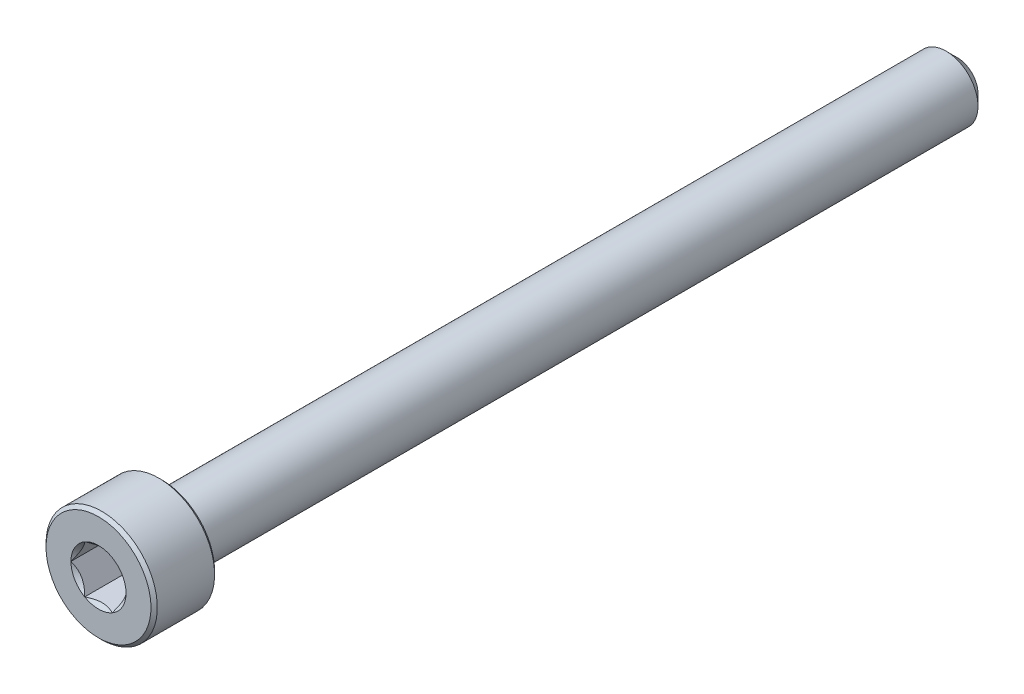
ISO-10303-21;
HEADER;
FILE_DESCRIPTION(('STEP AP214'),'2;1');
FILE_NAME('part.step','',(''),(''),'','','');
FILE_SCHEMA(('AUTOMOTIVE_DESIGN { 1 0 10303 214 1 1 1 1 }'));
ENDSEC;
DATA;
#1=APPLICATION_CONTEXT('core data for automotive mechanical design processes');
#2=APPLICATION_PROTOCOL_DEFINITION('international standard','automotive_design',2000,#1);
#3=PRODUCT_CONTEXT('',#1,'mechanical');
#4=PRODUCT('Part','Part','',(#3));
#5=PRODUCT_RELATED_PRODUCT_CATEGORY('part','',(#4));
#6=PRODUCT_DEFINITION_FORMATION('','',#4);
#7=PRODUCT_DEFINITION_CONTEXT('part definition',#1,'design');
#8=PRODUCT_DEFINITION('design','',#6,#7);
#9=PRODUCT_DEFINITION_SHAPE('','',#8);
#10=(LENGTH_UNIT() NAMED_UNIT(*) SI_UNIT(.MILLI.,.METRE.));
#11=(NAMED_UNIT(*) PLANE_ANGLE_UNIT() SI_UNIT($,.RADIAN.));
#12=(NAMED_UNIT(*) SI_UNIT($,.STERADIAN.) SOLID_ANGLE_UNIT());
#13=UNCERTAINTY_MEASURE_WITH_UNIT(LENGTH_MEASURE(1.E-05),#10,'distance_accuracy_value','');
#14=(GEOMETRIC_REPRESENTATION_CONTEXT(3) GLOBAL_UNCERTAINTY_ASSIGNED_CONTEXT((#13)) GLOBAL_UNIT_ASSIGNED_CONTEXT((#10,
#11,#12)) REPRESENTATION_CONTEXT('',''));
#15=CARTESIAN_POINT('',(0.,0.,0.));
#16=DIRECTION('',(0.,0.,1.));
#17=DIRECTION('',(1.,0.,0.));
#18=AXIS2_PLACEMENT_3D('',#15,#16,#17);
#19=CARTESIAN_POINT('',(0.,0.,27.));
#20=DIRECTION('',(0.,0.,1.));
#21=DIRECTION('',(1.,0.,0.));
#22=AXIS2_PLACEMENT_3D('',#19,#20,#21);
#23=PLANE('',#22);
#24=CARTESIAN_POINT('',(0.,0.,27.));
#25=DIRECTION('',(0.,0.,1.));
#26=DIRECTION('',(1.,0.,0.));
#27=AXIS2_PLACEMENT_3D('',#24,#25,#26);
#28=CIRCLE('',#27,1.73205080756888);
#29=CARTESIAN_POINT('',(1.73205080756888,0.,27.));
#30=VERTEX_POINT('',#29);
#31=CARTESIAN_POINT('',(0.866025403784439,1.5,27.));
#32=VERTEX_POINT('',#31);
#33=EDGE_CURVE('E112',#30,#32,#28,.T.);
#34=ORIENTED_EDGE('',*,*,#33,.F.);
#35=CARTESIAN_POINT('',(0.866025403784438,-1.5,27.));
#36=VERTEX_POINT('',#35);
#37=EDGE_CURVE('E101',#36,#30,#28,.T.);
#38=ORIENTED_EDGE('',*,*,#37,.F.);
#39=CARTESIAN_POINT('',(-0.866025403784438,-1.5,27.));
#40=VERTEX_POINT('',#39);
#41=EDGE_CURVE('E110',#40,#36,#28,.T.);
#42=ORIENTED_EDGE('',*,*,#41,.F.);
#43=CARTESIAN_POINT('',(-1.73205080756888,0.,27.));
#44=VERTEX_POINT('',#43);
#45=EDGE_CURVE('E298',#44,#40,#28,.T.);
#46=ORIENTED_EDGE('',*,*,#45,.F.);
#47=CARTESIAN_POINT('',(-0.866025403784438,1.5,27.));
#48=VERTEX_POINT('',#47);
#49=EDGE_CURVE('E138',#48,#44,#28,.T.);
#50=ORIENTED_EDGE('',*,*,#49,.F.);
#51=EDGE_CURVE('E135',#32,#48,#28,.T.);
#52=ORIENTED_EDGE('',*,*,#51,.F.);
#53=EDGE_LOOP('',(#34,#38,#42,#46,#50,#52));
#54=FACE_BOUND('',#53,.T.);
#55=CARTESIAN_POINT('',(0.,0.,27.));
#56=DIRECTION('',(0.,0.,-1.));
#57=DIRECTION('',(-1.,0.,0.));
#58=AXIS2_PLACEMENT_3D('',#55,#56,#57);
#59=CIRCLE('',#58,3.3);
#60=CARTESIAN_POINT('',(-3.3,0.,27.));
#61=VERTEX_POINT('',#60);
#62=EDGE_CURVE('E55',#61,#61,#59,.T.);
#63=ORIENTED_EDGE('',*,*,#62,.F.);
#64=EDGE_LOOP('',(#63));
#65=FACE_BOUND('',#64,.T.);
#66=ADVANCED_FACE('F41',(#54,#65),#23,.T.);
#67=CARTESIAN_POINT('',(0.,0.,26.8));
#68=DIRECTION('',(0.,0.,-1.));
#69=DIRECTION('',(-1.,0.,0.));
#70=AXIS2_PLACEMENT_3D('',#67,#68,#69);
#71=CONICAL_SURFACE('',#70,3.5,0.785398163397454);
#72=ORIENTED_EDGE('',*,*,#62,.T.);
#73=EDGE_LOOP('',(#72));
#74=FACE_BOUND('',#73,.T.);
#75=CARTESIAN_POINT('',(0.,0.,26.8));
#76=DIRECTION('',(0.,0.,-1.));
#77=DIRECTION('',(-1.,0.,0.));
#78=AXIS2_PLACEMENT_3D('',#75,#76,#77);
#79=CIRCLE('',#78,3.5);
#80=CARTESIAN_POINT('',(-3.5,0.,26.8));
#81=VERTEX_POINT('',#80);
#82=EDGE_CURVE('E233',#81,#81,#79,.T.);
#83=ORIENTED_EDGE('',*,*,#82,.F.);
#84=EDGE_LOOP('',(#83));
#85=FACE_BOUND('',#84,.T.);
#86=ADVANCED_FACE('F221',(#74,#85),#71,.T.);
#87=CARTESIAN_POINT('',(0.,0.,-27.));
#88=DIRECTION('',(0.,0.,-1.));
#89=DIRECTION('',(-1.,0.,0.));
#90=AXIS2_PLACEMENT_3D('',#87,#88,#89);
#91=CYLINDRICAL_SURFACE('',#90,3.5);
#92=ORIENTED_EDGE('',*,*,#82,.T.);
#93=EDGE_LOOP('',(#92));
#94=FACE_BOUND('',#93,.T.);
#95=CARTESIAN_POINT('',(0.,0.,23.2));
#96=DIRECTION('',(0.,0.,-1.));
#97=DIRECTION('',(-1.,0.,0.));
#98=AXIS2_PLACEMENT_3D('',#95,#96,#97);
#99=CIRCLE('',#98,3.5);
#100=CARTESIAN_POINT('',(-3.5,0.,23.2));
#101=VERTEX_POINT('',#100);
#102=EDGE_CURVE('E235',#101,#101,#99,.T.);
#103=ORIENTED_EDGE('',*,*,#102,.F.);
#104=EDGE_LOOP('',(#103));
#105=FACE_BOUND('',#104,.T.);
#106=ADVANCED_FACE('F218',(#94,#105),#91,.T.);
#107=CARTESIAN_POINT('',(0.,0.,23.));
#108=DIRECTION('',(0.,0.,1.));
#109=DIRECTION('',(1.,0.,0.));
#110=AXIS2_PLACEMENT_3D('',#107,#108,#109);
#111=CONICAL_SURFACE('',#110,3.3,0.785398163397454);
#112=ORIENTED_EDGE('',*,*,#102,.T.);
#113=EDGE_LOOP('',(#112));
#114=FACE_BOUND('',#113,.T.);
#115=CARTESIAN_POINT('',(0.,0.,23.));
#116=DIRECTION('',(0.,0.,-1.));
#117=DIRECTION('',(-1.,0.,0.));
#118=AXIS2_PLACEMENT_3D('',#115,#116,#117);
#119=CIRCLE('',#118,3.3);
#120=CARTESIAN_POINT('',(-3.3,0.,23.));
#121=VERTEX_POINT('',#120);
#122=EDGE_CURVE('E240',#121,#121,#119,.T.);
#123=ORIENTED_EDGE('',*,*,#122,.F.);
#124=EDGE_LOOP('',(#123));
#125=FACE_BOUND('',#124,.T.);
#126=ADVANCED_FACE('F214',(#114,#125),#111,.T.);
#127=CARTESIAN_POINT('',(0.,3.3,23.));
#128=DIRECTION('',(0.,0.,-1.));
#129=DIRECTION('',(-1.,0.,0.));
#130=AXIS2_PLACEMENT_3D('',#127,#128,#129);
#131=PLANE('',#130);
#132=ORIENTED_EDGE('',*,*,#122,.T.);
#133=EDGE_LOOP('',(#132));
#134=FACE_BOUND('',#133,.T.);
#135=CARTESIAN_POINT('',(0.,0.,23.));
#136=DIRECTION('',(0.,0.,-1.));
#137=DIRECTION('',(-1.,0.,0.));
#138=AXIS2_PLACEMENT_3D('',#135,#136,#137);
#139=CIRCLE('',#138,2.);
#140=CARTESIAN_POINT('',(-2.,0.,23.));
#141=VERTEX_POINT('',#140);
#142=EDGE_CURVE('E246',#141,#141,#139,.T.);
#143=ORIENTED_EDGE('',*,*,#142,.F.);
#144=EDGE_LOOP('',(#143));
#145=FACE_BOUND('',#144,.T.);
#146=ADVANCED_FACE('F210',(#134,#145),#131,.T.);
#147=CARTESIAN_POINT('',(0.,0.,-27.));
#148=DIRECTION('',(0.,0.,-1.));
#149=DIRECTION('',(-1.,0.,0.));
#150=AXIS2_PLACEMENT_3D('',#147,#148,#149);
#151=CYLINDRICAL_SURFACE('',#150,2.);
#152=ORIENTED_EDGE('',*,*,#142,.T.);
#153=EDGE_LOOP('',(#152));
#154=FACE_BOUND('',#153,.T.);
#155=CARTESIAN_POINT('',(0.,0.,-26.3));
#156=DIRECTION('',(0.,0.,-1.));
#157=DIRECTION('',(-1.,0.,0.));
#158=AXIS2_PLACEMENT_3D('',#155,#156,#157);
#159=CIRCLE('',#158,2.);
#160=CARTESIAN_POINT('',(-2.,0.,-26.3));
#161=VERTEX_POINT('',#160);
#162=EDGE_CURVE('E250',#161,#161,#159,.T.);
#163=ORIENTED_EDGE('',*,*,#162,.F.);
#164=EDGE_LOOP('',(#163));
#165=FACE_BOUND('',#164,.T.);
#166=ADVANCED_FACE('F206',(#154,#165),#151,.T.);
#167=CARTESIAN_POINT('',(0.,0.,-27.));
#168=DIRECTION('',(0.,0.,1.));
#169=DIRECTION('',(1.,0.,0.));
#170=AXIS2_PLACEMENT_3D('',#167,#168,#169);
#171=CONICAL_SURFACE('',#170,1.3,0.78539816339744);
#172=ORIENTED_EDGE('',*,*,#162,.T.);
#173=EDGE_LOOP('',(#172));
#174=FACE_BOUND('',#173,.T.);
#175=CARTESIAN_POINT('',(0.,0.,-27.));
#176=DIRECTION('',(0.,0.,-1.));
#177=DIRECTION('',(-1.,0.,0.));
#178=AXIS2_PLACEMENT_3D('',#175,#176,#177);
#179=CIRCLE('',#178,1.3);
#180=CARTESIAN_POINT('',(-1.3,0.,-27.));
#181=VERTEX_POINT('',#180);
#182=EDGE_CURVE('E254',#181,#181,#179,.T.);
#183=ORIENTED_EDGE('',*,*,#182,.F.);
#184=EDGE_LOOP('',(#183));
#185=FACE_BOUND('',#184,.T.);
#186=ADVANCED_FACE('F202',(#174,#185),#171,.T.);
#187=CARTESIAN_POINT('',(0.,1.3,-27.));
#188=DIRECTION('',(0.,0.,-1.));
#189=DIRECTION('',(-1.,0.,0.));
#190=AXIS2_PLACEMENT_3D('',#187,#188,#189);
#191=PLANE('',#190);
#192=ORIENTED_EDGE('',*,*,#182,.T.);
#193=EDGE_LOOP('',(#192));
#194=FACE_BOUND('',#193,.T.);
#195=ADVANCED_FACE('F199',(#194),#191,.T.);
#196=CARTESIAN_POINT('',(0.,0.,27.));
#197=DIRECTION('',(0.,0.,1.));
#198=DIRECTION('',(1.,0.,0.));
#199=AXIS2_PLACEMENT_3D('',#196,#197,#198);
#200=CONICAL_SURFACE('',#199,1.73205080756888,0.78539816339745);
#201=ORIENTED_EDGE('',*,*,#33,.T.);
#202=CARTESIAN_POINT('',(1.73216627762272,-0.000200000000000874,27.0001154816001));
#203=CARTESIAN_POINT('',(1.70239359975915,0.0513677907370746,26.9703654760673));
#204=CARTESIAN_POINT('',(1.67212305186355,0.1037979176652,26.9423624839103));
#205=CARTESIAN_POINT('',(1.61039789003619,0.210709034055596,26.8910892304401));
#206=CARTESIAN_POINT('',(1.57893740312614,0.265200195814661,26.8678475050444));
#207=CARTESIAN_POINT('',(1.51549879897987,0.375079081357249,26.8280337289922));
#208=CARTESIAN_POINT('',(1.4835368452681,0.4304388090952,26.8113615856709));
#209=CARTESIAN_POINT('',(1.41890915196211,0.542377257477152,26.7856744568181));
#210=CARTESIAN_POINT('',(1.38624538781118,0.59895255655301,26.7766402904789));
#211=CARTESIAN_POINT('',(1.32995210095299,0.696455389516443,26.7684890812268));
#212=CARTESIAN_POINT('',(1.30639533311124,0.737256908280468,26.7672822529892));
#213=CARTESIAN_POINT('',(1.25932335290193,0.81878796961586,26.7693140571623));
#214=CARTESIAN_POINT('',(1.23580815085313,0.859517494314632,26.7725536707483));
#215=CARTESIAN_POINT('',(1.18900414978426,0.940584402163418,26.783291985982));
#216=CARTESIAN_POINT('',(1.16571558211719,0.980921384598291,26.7907946530187));
#217=CARTESIAN_POINT('',(1.11952932016335,1.06091833691403,26.8096516119283));
#218=CARTESIAN_POINT('',(1.09663179808786,1.10057800851621,26.8210075570186));
#219=CARTESIAN_POINT('',(1.03798159809698,1.20216313477449,26.8547216475927));
#220=CARTESIAN_POINT('',(1.00259267147465,1.26345855370969,26.8796218490934));
#221=CARTESIAN_POINT('',(0.950557780604374,1.35358562846331,26.9216566532716));
#222=CARTESIAN_POINT('',(0.933410759677147,1.38328513990772,26.9364251535591));
#223=CARTESIAN_POINT('',(0.899432101996406,1.44213790138375,26.9673105659402));
#224=CARTESIAN_POINT('',(0.88260031928571,1.47129140422064,26.9834268341217));
#225=CARTESIAN_POINT('',(0.865909933730601,1.5002,27.0001154816001));
#226=B_SPLINE_CURVE_WITH_KNOTS('',3,(#202,#203,#204,#205,#206,#207,#208,#209,#210,#211,#212,
#213,#214,#215,#216,#217,#218,#219,#220,#221,#222,#223,#224,#225),.UNSPECIFIED.,.F.,.F.,(4,2,2,
2,2,2,2,2,2,2,2,4),(0.,0.199829143693305,0.40082298738239,0.598623720538184,0.795926240188893,
0.937113067959885,1.07833105577193,1.21968061668222,1.36109089931055,1.58570969637566,
1.69770705470964,1.80965120737194),.UNSPECIFIED.);
#227=EDGE_CURVE('E12',#30,#32,#226,.T.);
#228=ORIENTED_EDGE('',*,*,#227,.F.);
#229=EDGE_LOOP('',(#201,#228));
#230=FACE_BOUND('',#229,.T.);
#231=ADVANCED_FACE('F114',(#230),#200,.F.);
#232=ORIENTED_EDGE('',*,*,#37,.T.);
#233=CARTESIAN_POINT('',(0.8659099337306,-1.5002,27.0001154816001));
#234=CARTESIAN_POINT('',(0.895682611594165,-1.44863220926293,26.9703654760673));
#235=CARTESIAN_POINT('',(0.925953159489764,-1.3962020823348,26.9423624839103));
#236=CARTESIAN_POINT('',(0.987678321317123,-1.2892909659444,26.8910892304401));
#237=CARTESIAN_POINT('',(1.01913880822717,-1.23479980418534,26.8678475050444));
#238=CARTESIAN_POINT('',(1.08257741237344,-1.12492091864275,26.8280337289922));
#239=CARTESIAN_POINT('',(1.11453936608521,-1.0695611909048,26.8113615856709));
#240=CARTESIAN_POINT('',(1.1791670593912,-0.957622742522849,26.7856744568181));
#241=CARTESIAN_POINT('',(1.21183082354213,-0.901047443446991,26.7766402904789));
#242=CARTESIAN_POINT('',(1.26812411040032,-0.803544610483558,26.7684890812268));
#243=CARTESIAN_POINT('',(1.29168087824208,-0.762743091719533,26.7672822529892));
#244=CARTESIAN_POINT('',(1.33875285845138,-0.681212030384141,26.7693140571623));
#245=CARTESIAN_POINT('',(1.36226806050018,-0.64048250568537,26.7725536707483));
#246=CARTESIAN_POINT('',(1.40907206156905,-0.559415597836583,26.783291985982));
#247=CARTESIAN_POINT('',(1.43236062923612,-0.519078615401711,26.7907946530187));
#248=CARTESIAN_POINT('',(1.47854689118997,-0.439081663085968,26.8096516119283));
#249=CARTESIAN_POINT('',(1.50144441326545,-0.399421991483791,26.8210075570186));
#250=CARTESIAN_POINT('',(1.56009461325633,-0.297836865225514,26.8547216475927));
#251=CARTESIAN_POINT('',(1.59548353987866,-0.23654144629031,26.8796218490934));
#252=CARTESIAN_POINT('',(1.64751843074894,-0.146414371536685,26.9216566532716));
#253=CARTESIAN_POINT('',(1.66466545167617,-0.116714860092281,26.9364251535591));
#254=CARTESIAN_POINT('',(1.69864410935691,-0.0578620986162484,26.9673105659402));
#255=CARTESIAN_POINT('',(1.71547589206761,-0.0287085957793627,26.9834268341217));
#256=CARTESIAN_POINT('',(1.73216627762272,0.000199999999999534,27.0001154816001));
#257=B_SPLINE_CURVE_WITH_KNOTS('',3,(#233,#234,#235,#236,#237,#238,#239,#240,#241,#242,#243,
#244,#245,#246,#247,#248,#249,#250,#251,#252,#253,#254,#255,#256),.UNSPECIFIED.,.F.,.F.,(4,2,2,
2,2,2,2,2,2,2,2,4),(0.,0.199829143693305,0.40082298738239,0.598623720538183,0.795926240188891,
0.937113067959883,1.07833105577193,1.21968061668222,1.36109089931055,1.58570969637566,
1.69770705470964,1.80965120737194),.UNSPECIFIED.);
#258=EDGE_CURVE('E104',#36,#30,#257,.T.);
#259=ORIENTED_EDGE('',*,*,#258,.F.);
#260=EDGE_LOOP('',(#232,#259));
#261=FACE_BOUND('',#260,.T.);
#262=ADVANCED_FACE('F103',(#261),#200,.F.);
#263=ORIENTED_EDGE('',*,*,#41,.T.);
#264=CARTESIAN_POINT('',(-1.72720812969692,-1.5,27.5555785162708));
#265=CARTESIAN_POINT('',(-1.68515175699268,-1.5,27.5238299078574));
#266=CARTESIAN_POINT('',(-1.64286104748674,-1.5,27.4923925938074));
#267=CARTESIAN_POINT('',(-1.55771581035942,-1.5,27.4302690875564));
#268=CARTESIAN_POINT('',(-1.51486114386668,-1.5,27.3995830858922));
#269=CARTESIAN_POINT('',(-1.3846813415127,-1.5,27.3084071924272));
#270=CARTESIAN_POINT('',(-1.29637976071654,-1.5,27.2492883434268));
#271=CARTESIAN_POINT('',(-1.11121478730467,-1.5,27.1332309963165));
#272=CARTESIAN_POINT('',(-1.01415038238167,-1.5,27.076609558733));
#273=CARTESIAN_POINT('',(-0.815173408897603,-1.5,26.9730368812656));
#274=CARTESIAN_POINT('',(-0.713278669253283,-1.5,26.9260530415417));
#275=CARTESIAN_POINT('',(-0.56033377494311,-1.5,26.8685726684308));
#276=CARTESIAN_POINT('',(-0.511547982948041,-1.5,26.8520753877572));
#277=CARTESIAN_POINT('',(-0.412798620136866,-1.5,26.822997512927));
#278=CARTESIAN_POINT('',(-0.362834968437562,-1.5,26.810417188594));
#279=CARTESIAN_POINT('',(-0.262863235444983,-1.5,26.7900361941468));
#280=CARTESIAN_POINT('',(-0.212872113808024,-1.5,26.782153632746));
#281=CARTESIAN_POINT('',(-0.112355243569547,-1.5,26.771322063969));
#282=CARTESIAN_POINT('',(-0.0618295883726288,-1.5,26.7683722085243));
#283=CARTESIAN_POINT('',(0.0374291733323834,-1.5,26.7676248577248));
#284=CARTESIAN_POINT('',(0.0861609672002981,-1.5,26.7696447335581));
#285=CARTESIAN_POINT('',(0.183206937768826,-1.5,26.7783225528968));
#286=CARTESIAN_POINT('',(0.231521073438268,-1.5,26.7849809469685));
#287=CARTESIAN_POINT('',(0.328199853425434,-1.5,26.8026852441226));
#288=CARTESIAN_POINT('',(0.376550616310327,-1.5,26.813805811257));
#289=CARTESIAN_POINT('',(0.472195697125598,-1.5,26.8398434140487));
#290=CARTESIAN_POINT('',(0.51949010309274,-1.5,26.8547601320409));
#291=CARTESIAN_POINT('',(0.668391282696623,-1.5,26.9073352235961));
#292=CARTESIAN_POINT('',(0.767878709508551,-1.5,26.950981287472));
#293=CARTESIAN_POINT('',(0.962179866690722,-1.5,27.0480229945931));
#294=CARTESIAN_POINT('',(1.05697519961444,-1.5,27.1014536650895));
#295=CARTESIAN_POINT('',(1.23814273533383,-1.5,27.2116858520046));
#296=CARTESIAN_POINT('',(1.32469942181289,-1.5,27.2681879206986));
#297=CARTESIAN_POINT('',(1.45222331290673,-1.5,27.3555343015787));
#298=CARTESIAN_POINT('',(1.49418091978756,-1.5,27.38495775868));
#299=CARTESIAN_POINT('',(1.57752272931476,-1.5,27.4445828218305));
#300=CARTESIAN_POINT('',(1.61890708647354,-1.5,27.4747842116644));
#301=CARTESIAN_POINT('',(1.66005278019494,-1.5,27.5053081786095));
#302=B_SPLINE_CURVE_WITH_KNOTS('',3,(#264,#265,#266,#267,#268,#269,#270,#271,#272,#273,#274,
#275,#276,#277,#278,#279,#280,#281,#282,#283,#284,#285,#286,#287,#288,#289,#290,#291,#292,#293,
#294,#295,#296,#297,#298,#299,#300,#301),.UNSPECIFIED.,.F.,.F.,(4,2,2,2,2,2,2,2,2,2,2,2,2,2,2,2,
2,2,4),(0.,0.158079548982667,0.31619878099394,0.634850417346958,0.97169031136151,
1.30737131660667,1.46173961127089,1.61611853740677,1.76772101421409,1.91929742368538,
2.065387412096,2.21149159305544,2.36014984633872,2.50879566386709,2.83376031422673,
3.15991186985651,3.46985601802197,3.62358896039973,3.7772796264207),.UNSPECIFIED.);
#303=EDGE_CURVE('E124',#40,#36,#302,.T.);
#304=ORIENTED_EDGE('',*,*,#303,.F.);
#305=EDGE_LOOP('',(#263,#304));
#306=FACE_BOUND('',#305,.T.);
#307=ADVANCED_FACE('F307',(#306),#200,.F.);
#308=ORIENTED_EDGE('',*,*,#45,.T.);
#309=CARTESIAN_POINT('',(-1.73216627762272,0.000200000000000134,27.0001154816001));
#310=CARTESIAN_POINT('',(-1.70239359975915,-0.0513677907370754,26.9703654760673));
#311=CARTESIAN_POINT('',(-1.67212305186355,-0.103797917665201,26.9423624839103));
#312=CARTESIAN_POINT('',(-1.61039789003619,-0.210709034055597,26.8910892304401));
#313=CARTESIAN_POINT('',(-1.57893740312614,-0.265200195814662,26.8678475050444));
#314=CARTESIAN_POINT('',(-1.51549879897987,-0.37507908135725,26.8280337289922));
#315=CARTESIAN_POINT('',(-1.4835368452681,-0.430438809095201,26.8113615856709));
#316=CARTESIAN_POINT('',(-1.41890915196211,-0.542377257477152,26.7856744568181));
#317=CARTESIAN_POINT('',(-1.38624538781118,-0.59895255655301,26.7766402904789));
#318=CARTESIAN_POINT('',(-1.32995210095299,-0.696455389516442,26.7684890812268));
#319=CARTESIAN_POINT('',(-1.30639533311124,-0.737256908280468,26.7672822529892));
#320=CARTESIAN_POINT('',(-1.25932335290193,-0.818787969615859,26.7693140571623));
#321=CARTESIAN_POINT('',(-1.23580815085313,-0.859517494314631,26.7725536707483));
#322=CARTESIAN_POINT('',(-1.18900414978427,-0.940584402163417,26.783291985982));
#323=CARTESIAN_POINT('',(-1.16571558211719,-0.98092138459829,26.7907946530187));
#324=CARTESIAN_POINT('',(-1.11952932016335,-1.06091833691403,26.8096516119283));
#325=CARTESIAN_POINT('',(-1.09663179808786,-1.10057800851621,26.8210075570186));
#326=CARTESIAN_POINT('',(-1.03798159809698,-1.20216313477449,26.8547216475927));
#327=CARTESIAN_POINT('',(-1.00259267147465,-1.26345855370969,26.8796218490934));
#328=CARTESIAN_POINT('',(-0.950557780604374,-1.35358562846332,26.9216566532716));
#329=CARTESIAN_POINT('',(-0.933410759677147,-1.38328513990772,26.9364251535591));
#330=CARTESIAN_POINT('',(-0.899432101996406,-1.44213790138375,26.9673105659402));
#331=CARTESIAN_POINT('',(-0.88260031928571,-1.47129140422064,26.9834268341217));
#332=CARTESIAN_POINT('',(-0.865909933730601,-1.5002,27.0001154816001));
#333=B_SPLINE_CURVE_WITH_KNOTS('',3,(#309,#310,#311,#312,#313,#314,#315,#316,#317,#318,#319,
#320,#321,#322,#323,#324,#325,#326,#327,#328,#329,#330,#331,#332),.UNSPECIFIED.,.F.,.F.,(4,2,2,
2,2,2,2,2,2,2,2,4),(0.,0.199829143693306,0.40082298738239,0.598623720538183,0.795926240188891,
0.937113067959883,1.07833105577193,1.21968061668222,1.36109089931055,1.58570969637566,
1.69770705470964,1.80965120737194),.UNSPECIFIED.);
#334=EDGE_CURVE('E164',#44,#40,#333,.T.);
#335=ORIENTED_EDGE('',*,*,#334,.F.);
#336=EDGE_LOOP('',(#308,#335));
#337=FACE_BOUND('',#336,.T.);
#338=ADVANCED_FACE('F342',(#337),#200,.F.);
#339=ORIENTED_EDGE('',*,*,#49,.T.);
#340=CARTESIAN_POINT('',(-0.865909933730601,1.5002,27.0001154816001));
#341=CARTESIAN_POINT('',(-0.895682611594165,1.44863220926292,26.9703654760673));
#342=CARTESIAN_POINT('',(-0.925953159489764,1.3962020823348,26.9423624839103));
#343=CARTESIAN_POINT('',(-0.987678321317123,1.2892909659444,26.8910892304401));
#344=CARTESIAN_POINT('',(-1.01913880822717,1.23479980418534,26.8678475050444));
#345=CARTESIAN_POINT('',(-1.08257741237344,1.12492091864275,26.8280337289922));
#346=CARTESIAN_POINT('',(-1.11453936608521,1.0695611909048,26.8113615856709));
#347=CARTESIAN_POINT('',(-1.1791670593912,0.957622742522849,26.7856744568181));
#348=CARTESIAN_POINT('',(-1.21183082354213,0.901047443446991,26.7766402904789));
#349=CARTESIAN_POINT('',(-1.26812411040032,0.803544610483558,26.7684890812268));
#350=CARTESIAN_POINT('',(-1.29168087824208,0.762743091719533,26.7672822529892));
#351=CARTESIAN_POINT('',(-1.33875285845138,0.68121203038414,26.7693140571623));
#352=CARTESIAN_POINT('',(-1.36226806050018,0.640482505685369,26.7725536707483));
#353=CARTESIAN_POINT('',(-1.40907206156905,0.559415597836583,26.783291985982));
#354=CARTESIAN_POINT('',(-1.43236062923612,0.51907861540171,26.7907946530187));
#355=CARTESIAN_POINT('',(-1.47854689118997,0.439081663085968,26.8096516119283));
#356=CARTESIAN_POINT('',(-1.50144441326545,0.399421991483791,26.8210075570186));
#357=CARTESIAN_POINT('',(-1.56009461325633,0.297836865225514,26.8547216475927));
#358=CARTESIAN_POINT('',(-1.59548353987866,0.236541446290309,26.8796218490934));
#359=CARTESIAN_POINT('',(-1.64751843074894,0.146414371536686,26.9216566532716));
#360=CARTESIAN_POINT('',(-1.66466545167617,0.116714860092283,26.9364251535591));
#361=CARTESIAN_POINT('',(-1.69864410935691,0.0578620986162502,26.9673105659402));
#362=CARTESIAN_POINT('',(-1.71547589206761,0.0287085957793638,26.9834268341217));
#363=CARTESIAN_POINT('',(-1.73216627762272,-0.000199999999999435,27.0001154816001));
#364=B_SPLINE_CURVE_WITH_KNOTS('',3,(#340,#341,#342,#343,#344,#345,#346,#347,#348,#349,#350,
#351,#352,#353,#354,#355,#356,#357,#358,#359,#360,#361,#362,#363),.UNSPECIFIED.,.F.,.F.,(4,2,2,
2,2,2,2,2,2,2,2,4),(0.,0.199829143693305,0.40082298738239,0.598623720538182,0.795926240188891,
0.937113067959884,1.07833105577193,1.21968061668222,1.36109089931055,1.58570969637566,
1.69770705470964,1.80965120737194),.UNSPECIFIED.);
#365=EDGE_CURVE('E171',#48,#44,#364,.T.);
#366=ORIENTED_EDGE('',*,*,#365,.F.);
#367=EDGE_LOOP('',(#339,#366));
#368=FACE_BOUND('',#367,.T.);
#369=ADVANCED_FACE('F156',(#368),#200,.F.);
#370=ORIENTED_EDGE('',*,*,#51,.T.);
#371=CARTESIAN_POINT('',(-1.72720812969692,1.5,27.5555785162708));
#372=CARTESIAN_POINT('',(-1.68515175699267,1.5,27.5238299078574));
#373=CARTESIAN_POINT('',(-1.64286104748673,1.5,27.4923925938074));
#374=CARTESIAN_POINT('',(-1.55771581035942,1.5,27.4302690875564));
#375=CARTESIAN_POINT('',(-1.51486114386668,1.5,27.3995830858922));
#376=CARTESIAN_POINT('',(-1.3846813415127,1.5,27.3084071924272));
#377=CARTESIAN_POINT('',(-1.29637976071653,1.5,27.2492883434268));
#378=CARTESIAN_POINT('',(-1.11121478730467,1.5,27.1332309963165));
#379=CARTESIAN_POINT('',(-1.01415038238167,1.5,27.076609558733));
#380=CARTESIAN_POINT('',(-0.815173408897604,1.5,26.9730368812656));
#381=CARTESIAN_POINT('',(-0.713278669253283,1.5,26.9260530415417));
#382=CARTESIAN_POINT('',(-0.560333774943111,1.5,26.8685726684308));
#383=CARTESIAN_POINT('',(-0.511547982948041,1.5,26.8520753877572));
#384=CARTESIAN_POINT('',(-0.412798620136866,1.5,26.822997512927));
#385=CARTESIAN_POINT('',(-0.362834968437562,1.5,26.810417188594));
#386=CARTESIAN_POINT('',(-0.262863235444981,1.5,26.7900361941468));
#387=CARTESIAN_POINT('',(-0.212872113808021,1.5,26.782153632746));
#388=CARTESIAN_POINT('',(-0.112355243569544,1.5,26.771322063969));
#389=CARTESIAN_POINT('',(-0.061829588372626,1.5,26.7683722085243));
#390=CARTESIAN_POINT('',(0.0374291733323862,1.5,26.7676248577248));
#391=CARTESIAN_POINT('',(0.086160967200301,1.5,26.7696447335581));
#392=CARTESIAN_POINT('',(0.183206937768829,1.5,26.7783225528968));
#393=CARTESIAN_POINT('',(0.231521073438271,1.5,26.7849809469685));
#394=CARTESIAN_POINT('',(0.328199853425438,1.5,26.8026852441226));
#395=CARTESIAN_POINT('',(0.37655061631033,1.5,26.813805811257));
#396=CARTESIAN_POINT('',(0.4721956971256,1.5,26.8398434140487));
#397=CARTESIAN_POINT('',(0.519490103092741,1.5,26.8547601320409));
#398=CARTESIAN_POINT('',(0.668391282696625,1.5,26.9073352235961));
#399=CARTESIAN_POINT('',(0.767878709508554,1.5,26.950981287472));
#400=CARTESIAN_POINT('',(0.962179866690725,1.5,27.0480229945931));
#401=CARTESIAN_POINT('',(1.05697519961444,1.5,27.1014536650895));
#402=CARTESIAN_POINT('',(1.23814273533383,1.5,27.2116858520046));
#403=CARTESIAN_POINT('',(1.3246994218129,1.5,27.2681879206986));
#404=CARTESIAN_POINT('',(1.45222331290674,1.5,27.3555343015787));
#405=CARTESIAN_POINT('',(1.49418091978756,1.5,27.38495775868));
#406=CARTESIAN_POINT('',(1.57752272931476,1.5,27.4445828218305));
#407=CARTESIAN_POINT('',(1.61890708647354,1.5,27.4747842116644));
#408=CARTESIAN_POINT('',(1.66005278019494,1.5,27.5053081786095));
#409=B_SPLINE_CURVE_WITH_KNOTS('',3,(#371,#372,#373,#374,#375,#376,#377,#378,#379,#380,#381,
#382,#383,#384,#385,#386,#387,#388,#389,#390,#391,#392,#393,#394,#395,#396,#397,#398,#399,#400,
#401,#402,#403,#404,#405,#406,#407,#408),.UNSPECIFIED.,.F.,.F.,(4,2,2,2,2,2,2,2,2,2,2,2,2,2,2,2,
2,2,4),(0.,0.158079548982669,0.31619878099394,0.634850417346955,0.971690311361509,
1.30737131660667,1.46173961127088,1.61611853740677,1.76772101421409,1.91929742368538,
2.065387412096,2.21149159305544,2.36014984633872,2.50879566386709,2.83376031422673,
3.15991186985651,3.46985601802197,3.62358896039973,3.7772796264207),.UNSPECIFIED.);
#410=EDGE_CURVE('E61',#32,#48,#409,.F.);
#411=ORIENTED_EDGE('',*,*,#410,.F.);
#412=EDGE_LOOP('',(#370,#411));
#413=FACE_BOUND('',#412,.T.);
#414=ADVANCED_FACE('F152',(#413),#200,.F.);
#415=CARTESIAN_POINT('',(0.,3.3,24.));
#416=DIRECTION('',(0.,0.,-1.));
#417=DIRECTION('',(-1.,0.,0.));
#418=AXIS2_PLACEMENT_3D('',#415,#416,#417);
#419=PLANE('',#418);
#420=DIRECTION('',(-0.5,0.866025403784439,0.));
#421=VECTOR('',#420,1.);
#422=CARTESIAN_POINT('',(1.73205080756888,0.,24.));
#423=LINE('',#422,#421);
#424=CARTESIAN_POINT('',(1.73205080756888,0.,24.));
#425=VERTEX_POINT('',#424);
#426=CARTESIAN_POINT('',(0.866025403784438,1.5,24.));
#427=VERTEX_POINT('',#426);
#428=EDGE_CURVE('E128',#425,#427,#423,.T.);
#429=ORIENTED_EDGE('',*,*,#428,.T.);
#430=DIRECTION('',(-1.,0.,0.));
#431=VECTOR('',#430,1.);
#432=CARTESIAN_POINT('',(0.866025403784438,1.5,24.));
#433=LINE('',#432,#431);
#434=CARTESIAN_POINT('',(-0.866025403784439,1.5,24.));
#435=VERTEX_POINT('',#434);
#436=EDGE_CURVE('E266',#427,#435,#433,.T.);
#437=ORIENTED_EDGE('',*,*,#436,.T.);
#438=DIRECTION('',(-0.5,-0.866025403784438,0.));
#439=VECTOR('',#438,1.);
#440=CARTESIAN_POINT('',(-0.866025403784439,1.5,24.));
#441=LINE('',#440,#439);
#442=CARTESIAN_POINT('',(-1.73205080756888,0.,24.));
#443=VERTEX_POINT('',#442);
#444=EDGE_CURVE('E265',#435,#443,#441,.T.);
#445=ORIENTED_EDGE('',*,*,#444,.T.);
#446=DIRECTION('',(0.5,-0.866025403784439,0.));
#447=VECTOR('',#446,1.);
#448=CARTESIAN_POINT('',(-1.73205080756888,0.,24.));
#449=LINE('',#448,#447);
#450=CARTESIAN_POINT('',(-0.866025403784439,-1.5,24.));
#451=VERTEX_POINT('',#450);
#452=EDGE_CURVE('E271',#443,#451,#449,.T.);
#453=ORIENTED_EDGE('',*,*,#452,.T.);
#454=DIRECTION('',(1.,0.,0.));
#455=VECTOR('',#454,1.);
#456=CARTESIAN_POINT('',(-0.866025403784439,-1.5,24.));
#457=LINE('',#456,#455);
#458=CARTESIAN_POINT('',(0.866025403784438,-1.5,24.));
#459=VERTEX_POINT('',#458);
#460=EDGE_CURVE('E276',#451,#459,#457,.T.);
#461=ORIENTED_EDGE('',*,*,#460,.T.);
#462=DIRECTION('',(0.5,0.866025403784439,0.));
#463=VECTOR('',#462,1.);
#464=CARTESIAN_POINT('',(0.866025403784438,-1.5,24.));
#465=LINE('',#464,#463);
#466=EDGE_CURVE('E130',#459,#425,#465,.T.);
#467=ORIENTED_EDGE('',*,*,#466,.T.);
#468=EDGE_LOOP('',(#429,#437,#445,#453,#461,#467));
#469=FACE_BOUND('',#468,.T.);
#470=ADVANCED_FACE('F155',(#469),#419,.F.);
#471=CARTESIAN_POINT('',(1.73205080756888,0.,18.4174243050442));
#472=DIRECTION('',(0.866025403784439,0.5,0.));
#473=DIRECTION('',(-0.5,0.866025403784439,0.));
#474=AXIS2_PLACEMENT_3D('',#471,#472,#473);
#475=PLANE('',#474);
#476=DIRECTION('',(0.,0.,1.));
#477=VECTOR('',#476,1.);
#478=CARTESIAN_POINT('',(1.73205080756888,0.,18.4174243050442));
#479=LINE('',#478,#477);
#480=EDGE_CURVE('E121',#425,#30,#479,.T.);
#481=ORIENTED_EDGE('',*,*,#480,.T.);
#482=ORIENTED_EDGE('',*,*,#227,.T.);
#483=DIRECTION('',(0.,0.,1.));
#484=VECTOR('',#483,1.);
#485=CARTESIAN_POINT('',(0.866025403784438,1.5,18.4174243050442));
#486=LINE('',#485,#484);
#487=EDGE_CURVE('E258',#427,#32,#486,.T.);
#488=ORIENTED_EDGE('',*,*,#487,.F.);
#489=ORIENTED_EDGE('',*,*,#428,.F.);
#490=EDGE_LOOP('',(#481,#482,#488,#489));
#491=FACE_BOUND('',#490,.T.);
#492=ADVANCED_FACE('F126',(#491),#475,.F.);
#493=CARTESIAN_POINT('',(0.866025403784438,-1.5,18.4174243050442));
#494=DIRECTION('',(0.866025403784438,-0.5,0.));
#495=DIRECTION('',(0.5,0.866025403784439,0.));
#496=AXIS2_PLACEMENT_3D('',#493,#494,#495);
#497=PLANE('',#496);
#498=DIRECTION('',(0.,0.,1.));
#499=VECTOR('',#498,1.);
#500=CARTESIAN_POINT('',(0.866025403784438,-1.5,18.4174243050442));
#501=LINE('',#500,#499);
#502=EDGE_CURVE('E69',#459,#36,#501,.T.);
#503=ORIENTED_EDGE('',*,*,#502,.T.);
#504=ORIENTED_EDGE('',*,*,#258,.T.);
#505=ORIENTED_EDGE('',*,*,#480,.F.);
#506=ORIENTED_EDGE('',*,*,#466,.F.);
#507=EDGE_LOOP('',(#503,#504,#505,#506));
#508=FACE_BOUND('',#507,.T.);
#509=ADVANCED_FACE('F120',(#508),#497,.F.);
#510=CARTESIAN_POINT('',(-0.866025403784439,-1.5,18.4174243050442));
#511=DIRECTION('',(0.,-1.,0.));
#512=DIRECTION('',(1.,0.,0.));
#513=AXIS2_PLACEMENT_3D('',#510,#511,#512);
#514=PLANE('',#513);
#515=DIRECTION('',(0.,0.,1.));
#516=VECTOR('',#515,1.);
#517=CARTESIAN_POINT('',(-0.866025403784439,-1.5,18.4174243050442));
#518=LINE('',#517,#516);
#519=EDGE_CURVE('E272',#451,#40,#518,.T.);
#520=ORIENTED_EDGE('',*,*,#519,.T.);
#521=ORIENTED_EDGE('',*,*,#303,.T.);
#522=ORIENTED_EDGE('',*,*,#502,.F.);
#523=ORIENTED_EDGE('',*,*,#460,.F.);
#524=EDGE_LOOP('',(#520,#521,#522,#523));
#525=FACE_BOUND('',#524,.T.);
#526=ADVANCED_FACE('F314',(#525),#514,.F.);
#527=CARTESIAN_POINT('',(-1.73205080756888,0.,18.4174243050442));
#528=DIRECTION('',(-0.866025403784439,-0.5,0.));
#529=DIRECTION('',(0.5,-0.866025403784439,0.));
#530=AXIS2_PLACEMENT_3D('',#527,#528,#529);
#531=PLANE('',#530);
#532=DIRECTION('',(0.,0.,1.));
#533=VECTOR('',#532,1.);
#534=CARTESIAN_POINT('',(-1.73205080756888,0.,18.4174243050442));
#535=LINE('',#534,#533);
#536=EDGE_CURVE('E267',#443,#44,#535,.T.);
#537=ORIENTED_EDGE('',*,*,#536,.T.);
#538=ORIENTED_EDGE('',*,*,#334,.T.);
#539=ORIENTED_EDGE('',*,*,#519,.F.);
#540=ORIENTED_EDGE('',*,*,#452,.F.);
#541=EDGE_LOOP('',(#537,#538,#539,#540));
#542=FACE_BOUND('',#541,.T.);
#543=ADVANCED_FACE('F189',(#542),#531,.F.);
#544=CARTESIAN_POINT('',(-0.866025403784439,1.5,18.4174243050442));
#545=DIRECTION('',(-0.866025403784438,0.5,0.));
#546=DIRECTION('',(-0.5,-0.866025403784438,0.));
#547=AXIS2_PLACEMENT_3D('',#544,#545,#546);
#548=PLANE('',#547);
#549=DIRECTION('',(0.,0.,1.));
#550=VECTOR('',#549,1.);
#551=CARTESIAN_POINT('',(-0.866025403784439,1.5,18.4174243050442));
#552=LINE('',#551,#550);
#553=EDGE_CURVE('E261',#435,#48,#552,.T.);
#554=ORIENTED_EDGE('',*,*,#553,.T.);
#555=ORIENTED_EDGE('',*,*,#365,.T.);
#556=ORIENTED_EDGE('',*,*,#536,.F.);
#557=ORIENTED_EDGE('',*,*,#444,.F.);
#558=EDGE_LOOP('',(#554,#555,#556,#557));
#559=FACE_BOUND('',#558,.T.);
#560=ADVANCED_FACE('F185',(#559),#548,.F.);
#561=CARTESIAN_POINT('',(0.866025403784438,1.5,18.4174243050442));
#562=DIRECTION('',(0.,1.,0.));
#563=DIRECTION('',(0.,0.,1.));
#564=AXIS2_PLACEMENT_3D('',#561,#562,#563);
#565=PLANE('',#564);
#566=ORIENTED_EDGE('',*,*,#487,.T.);
#567=ORIENTED_EDGE('',*,*,#410,.T.);
#568=ORIENTED_EDGE('',*,*,#553,.F.);
#569=ORIENTED_EDGE('',*,*,#436,.F.);
#570=EDGE_LOOP('',(#566,#567,#568,#569));
#571=FACE_BOUND('',#570,.T.);
#572=ADVANCED_FACE('F188',(#571),#565,.F.);
#573=CLOSED_SHELL('',(#66,#86,#106,#126,#146,#166,#186,#195,#231,#262,#307,#338,#369,#414,#470,
#492,#509,#526,#543,#560,#572));
#574=MANIFOLD_SOLID_BREP('B2',#573);
#575=ADVANCED_BREP_SHAPE_REPRESENTATION('',(#18,#574),#14);
#576=SHAPE_DEFINITION_REPRESENTATION(#9,#575);
ENDSEC;
END-ISO-10303-21;
